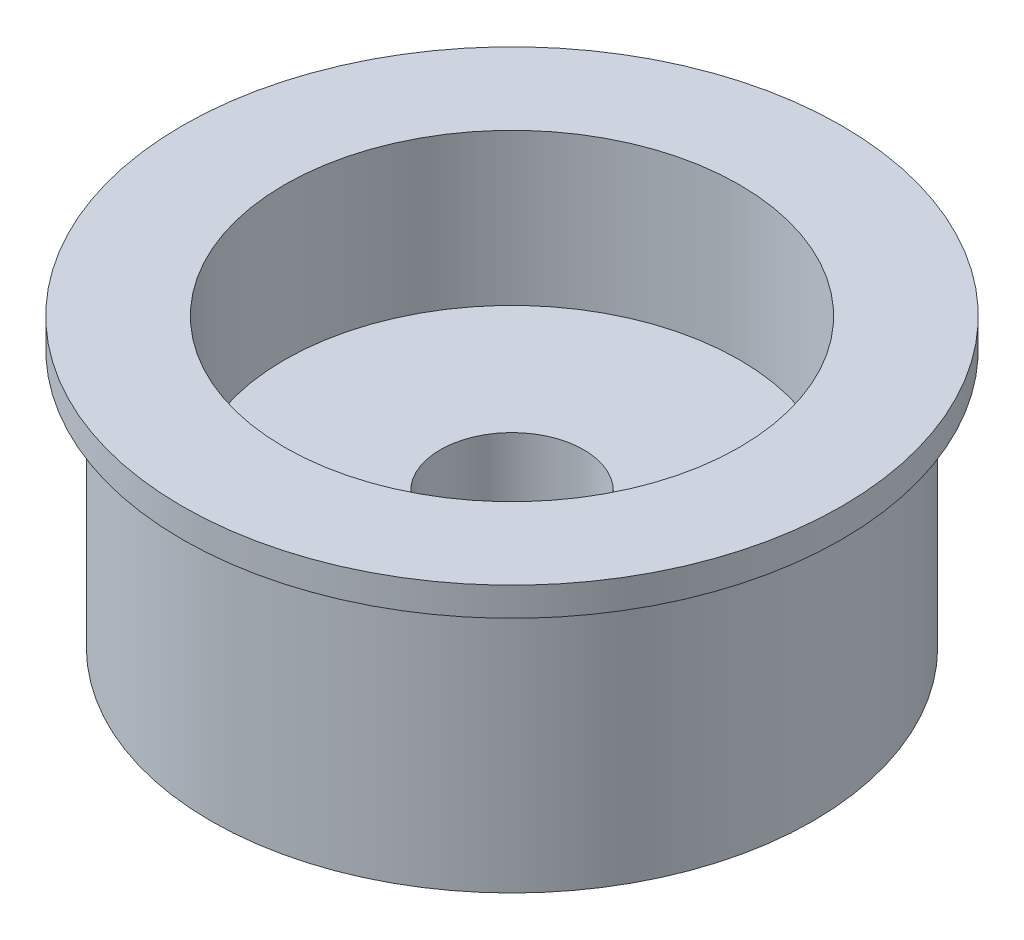
ISO-10303-21;
HEADER;
FILE_DESCRIPTION(('STEP AP214'),'2;1');
FILE_NAME('part.step','',(''),(''),'','','');
FILE_SCHEMA(('AUTOMOTIVE_DESIGN { 1 0 10303 214 1 1 1 1 }'));
ENDSEC;
DATA;
#1=APPLICATION_CONTEXT('core data for automotive mechanical design processes');
#2=APPLICATION_PROTOCOL_DEFINITION('international standard','automotive_design',2000,#1);
#3=PRODUCT_CONTEXT('',#1,'mechanical');
#4=PRODUCT('Part','Part','',(#3));
#5=PRODUCT_RELATED_PRODUCT_CATEGORY('part','',(#4));
#6=PRODUCT_DEFINITION_FORMATION('','',#4);
#7=PRODUCT_DEFINITION_CONTEXT('part definition',#1,'design');
#8=PRODUCT_DEFINITION('design','',#6,#7);
#9=PRODUCT_DEFINITION_SHAPE('','',#8);
#10=(LENGTH_UNIT() NAMED_UNIT(*) SI_UNIT(.MILLI.,.METRE.));
#11=(NAMED_UNIT(*) PLANE_ANGLE_UNIT() SI_UNIT($,.RADIAN.));
#12=(NAMED_UNIT(*) SI_UNIT($,.STERADIAN.) SOLID_ANGLE_UNIT());
#13=UNCERTAINTY_MEASURE_WITH_UNIT(LENGTH_MEASURE(1.E-05),#10,'distance_accuracy_value','');
#14=(GEOMETRIC_REPRESENTATION_CONTEXT(3) GLOBAL_UNCERTAINTY_ASSIGNED_CONTEXT((#13)) GLOBAL_UNIT_ASSIGNED_CONTEXT((#10,
#11,#12)) REPRESENTATION_CONTEXT('',''));
#15=CARTESIAN_POINT('',(0.,0.,0.));
#16=DIRECTION('',(0.,0.,1.));
#17=DIRECTION('',(1.,0.,0.));
#18=AXIS2_PLACEMENT_3D('',#15,#16,#17);
#19=CARTESIAN_POINT('',(0.,14.,0.));
#20=DIRECTION('',(0.,1.,0.));
#21=DIRECTION('',(0.,0.,1.));
#22=AXIS2_PLACEMENT_3D('',#19,#20,#21);
#23=PLANE('',#22);
#24=CARTESIAN_POINT('',(0.,14.,0.));
#25=DIRECTION('',(0.,1.,0.));
#26=DIRECTION('',(0.,0.,1.));
#27=AXIS2_PLACEMENT_3D('',#24,#25,#26);
#28=CIRCLE('',#27,11.1);
#29=CARTESIAN_POINT('',(0.,14.,11.1));
#30=VERTEX_POINT('',#29);
#31=EDGE_CURVE('E54',#30,#30,#28,.T.);
#32=ORIENTED_EDGE('',*,*,#31,.F.);
#33=EDGE_LOOP('',(#32));
#34=FACE_BOUND('',#33,.T.);
#35=CARTESIAN_POINT('',(0.,14.,0.));
#36=DIRECTION('',(0.,1.,0.));
#37=DIRECTION('',(0.,0.,1.));
#38=AXIS2_PLACEMENT_3D('',#35,#36,#37);
#39=CIRCLE('',#38,16.09);
#40=CARTESIAN_POINT('',(0.,14.,16.09));
#41=VERTEX_POINT('',#40);
#42=EDGE_CURVE('E60',#41,#41,#39,.T.);
#43=ORIENTED_EDGE('',*,*,#42,.T.);
#44=EDGE_LOOP('',(#43));
#45=FACE_BOUND('',#44,.T.);
#46=ADVANCED_FACE('F39',(#34,#45),#23,.T.);
#47=CARTESIAN_POINT('',(0.,6.6,0.));
#48=DIRECTION('',(0.,1.,0.));
#49=DIRECTION('',(0.,0.,1.));
#50=AXIS2_PLACEMENT_3D('',#47,#48,#49);
#51=CYLINDRICAL_SURFACE('',#50,11.1);
#52=CARTESIAN_POINT('',(0.,6.6,0.));
#53=DIRECTION('',(0.,1.,0.));
#54=DIRECTION('',(0.,0.,1.));
#55=AXIS2_PLACEMENT_3D('',#52,#53,#54);
#56=CIRCLE('',#55,11.1);
#57=CARTESIAN_POINT('',(0.,6.6,11.1));
#58=VERTEX_POINT('',#57);
#59=EDGE_CURVE('E50',#58,#58,#56,.T.);
#60=ORIENTED_EDGE('',*,*,#59,.F.);
#61=EDGE_LOOP('',(#60));
#62=FACE_BOUND('',#61,.T.);
#63=ORIENTED_EDGE('',*,*,#31,.T.);
#64=EDGE_LOOP('',(#63));
#65=FACE_BOUND('',#64,.T.);
#66=ADVANCED_FACE('F85',(#62,#65),#51,.F.);
#67=CARTESIAN_POINT('',(0.,6.6,0.));
#68=DIRECTION('',(0.,1.,0.));
#69=DIRECTION('',(0.,0.,1.));
#70=AXIS2_PLACEMENT_3D('',#67,#68,#69);
#71=PLANE('',#70);
#72=CARTESIAN_POINT('',(0.,6.6,0.));
#73=DIRECTION('',(0.,1.,0.));
#74=DIRECTION('',(0.,0.,1.));
#75=AXIS2_PLACEMENT_3D('',#72,#73,#74);
#76=CIRCLE('',#75,3.5);
#77=CARTESIAN_POINT('',(0.,6.6,3.5));
#78=VERTEX_POINT('',#77);
#79=EDGE_CURVE('E66',#78,#78,#76,.T.);
#80=ORIENTED_EDGE('',*,*,#79,.F.);
#81=EDGE_LOOP('',(#80));
#82=FACE_BOUND('',#81,.T.);
#83=ORIENTED_EDGE('',*,*,#59,.T.);
#84=EDGE_LOOP('',(#83));
#85=FACE_BOUND('',#84,.T.);
#86=ADVANCED_FACE('F81',(#82,#85),#71,.T.);
#87=CARTESIAN_POINT('',(0.,12.6,0.));
#88=DIRECTION('',(0.,1.,0.));
#89=DIRECTION('',(0.,0.,1.));
#90=AXIS2_PLACEMENT_3D('',#87,#88,#89);
#91=CYLINDRICAL_SURFACE('',#90,16.09);
#92=CARTESIAN_POINT('',(0.,12.6,0.));
#93=DIRECTION('',(0.,1.,0.));
#94=DIRECTION('',(0.,0.,1.));
#95=AXIS2_PLACEMENT_3D('',#92,#93,#94);
#96=CIRCLE('',#95,16.09);
#97=CARTESIAN_POINT('',(0.,12.6,16.09));
#98=VERTEX_POINT('',#97);
#99=EDGE_CURVE('E58',#98,#98,#96,.T.);
#100=ORIENTED_EDGE('',*,*,#99,.T.);
#101=EDGE_LOOP('',(#100));
#102=FACE_BOUND('',#101,.T.);
#103=ORIENTED_EDGE('',*,*,#42,.F.);
#104=EDGE_LOOP('',(#103));
#105=FACE_BOUND('',#104,.T.);
#106=ADVANCED_FACE('F84',(#102,#105),#91,.T.);
#107=CARTESIAN_POINT('',(0.,12.6,0.));
#108=DIRECTION('',(0.,1.,0.));
#109=DIRECTION('',(0.,0.,1.));
#110=AXIS2_PLACEMENT_3D('',#107,#108,#109);
#111=PLANE('',#110);
#112=CARTESIAN_POINT('',(0.,12.6,0.));
#113=DIRECTION('',(0.,1.,0.));
#114=DIRECTION('',(0.,0.,1.));
#115=AXIS2_PLACEMENT_3D('',#112,#113,#114);
#116=CIRCLE('',#115,14.69);
#117=CARTESIAN_POINT('',(0.,12.6,14.69));
#118=VERTEX_POINT('',#117);
#119=EDGE_CURVE('E10',#118,#118,#116,.T.);
#120=ORIENTED_EDGE('',*,*,#119,.T.);
#121=EDGE_LOOP('',(#120));
#122=FACE_BOUND('',#121,.T.);
#123=ORIENTED_EDGE('',*,*,#99,.F.);
#124=EDGE_LOOP('',(#123));
#125=FACE_BOUND('',#124,.T.);
#126=ADVANCED_FACE('F100',(#122,#125),#111,.F.);
#127=CARTESIAN_POINT('',(0.,0.,0.));
#128=DIRECTION('',(0.,1.,0.));
#129=DIRECTION('',(0.,0.,1.));
#130=AXIS2_PLACEMENT_3D('',#127,#128,#129);
#131=PLANE('',#130);
#132=CARTESIAN_POINT('',(0.,0.,0.));
#133=DIRECTION('',(0.,1.,0.));
#134=DIRECTION('',(0.,0.,1.));
#135=AXIS2_PLACEMENT_3D('',#132,#133,#134);
#136=CIRCLE('',#135,3.5);
#137=CARTESIAN_POINT('',(0.,0.,3.5));
#138=VERTEX_POINT('',#137);
#139=EDGE_CURVE('E63',#138,#138,#136,.T.);
#140=ORIENTED_EDGE('',*,*,#139,.T.);
#141=EDGE_LOOP('',(#140));
#142=FACE_BOUND('',#141,.T.);
#143=CARTESIAN_POINT('',(0.,0.,0.));
#144=DIRECTION('',(0.,1.,0.));
#145=DIRECTION('',(0.,0.,1.));
#146=AXIS2_PLACEMENT_3D('',#143,#144,#145);
#147=CIRCLE('',#146,14.69);
#148=CARTESIAN_POINT('',(0.,0.,14.69));
#149=VERTEX_POINT('',#148);
#150=EDGE_CURVE('E46',#149,#149,#147,.T.);
#151=ORIENTED_EDGE('',*,*,#150,.F.);
#152=EDGE_LOOP('',(#151));
#153=FACE_BOUND('',#152,.T.);
#154=ADVANCED_FACE('F72',(#142,#153),#131,.F.);
#155=CARTESIAN_POINT('',(0.,14.,0.));
#156=DIRECTION('',(0.,-1.,0.));
#157=DIRECTION('',(0.,0.,-1.));
#158=AXIS2_PLACEMENT_3D('',#155,#156,#157);
#159=CYLINDRICAL_SURFACE('',#158,14.69);
#160=ORIENTED_EDGE('',*,*,#150,.T.);
#161=EDGE_LOOP('',(#160));
#162=FACE_BOUND('',#161,.T.);
#163=ORIENTED_EDGE('',*,*,#119,.F.);
#164=EDGE_LOOP('',(#163));
#165=FACE_BOUND('',#164,.T.);
#166=ADVANCED_FACE('F41',(#162,#165),#159,.T.);
#167=CARTESIAN_POINT('',(0.,0.,0.));
#168=DIRECTION('',(0.,1.,0.));
#169=DIRECTION('',(0.,0.,1.));
#170=AXIS2_PLACEMENT_3D('',#167,#168,#169);
#171=CYLINDRICAL_SURFACE('',#170,3.5);
#172=ORIENTED_EDGE('',*,*,#139,.F.);
#173=EDGE_LOOP('',(#172));
#174=FACE_BOUND('',#173,.T.);
#175=ORIENTED_EDGE('',*,*,#79,.T.);
#176=EDGE_LOOP('',(#175));
#177=FACE_BOUND('',#176,.T.);
#178=ADVANCED_FACE('F75',(#174,#177),#171,.F.);
#179=CLOSED_SHELL('',(#46,#66,#86,#106,#126,#154,#166,#178));
#180=MANIFOLD_SOLID_BREP('B2',#179);
#181=ADVANCED_BREP_SHAPE_REPRESENTATION('',(#18,#180),#14);
#182=SHAPE_DEFINITION_REPRESENTATION(#9,#181);
ENDSEC;
END-ISO-10303-21;
